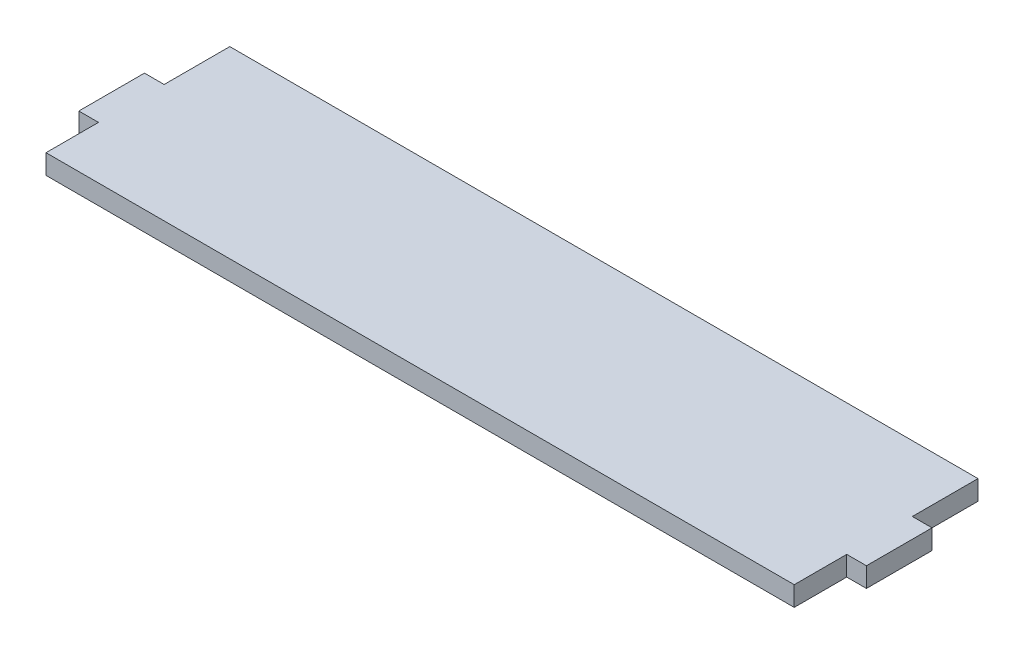
ISO-10303-21;
HEADER;
FILE_DESCRIPTION(('STEP AP214'),'2;1');
FILE_NAME('part.step','',(''),(''),'','','');
FILE_SCHEMA(('AUTOMOTIVE_DESIGN { 1 0 10303 214 1 1 1 1 }'));
ENDSEC;
DATA;
#1=APPLICATION_CONTEXT('core data for automotive mechanical design processes');
#2=APPLICATION_PROTOCOL_DEFINITION('international standard','automotive_design',2000,#1);
#3=PRODUCT_CONTEXT('',#1,'mechanical');
#4=PRODUCT('Part','Part','',(#3));
#5=PRODUCT_RELATED_PRODUCT_CATEGORY('part','',(#4));
#6=PRODUCT_DEFINITION_FORMATION('','',#4);
#7=PRODUCT_DEFINITION_CONTEXT('part definition',#1,'design');
#8=PRODUCT_DEFINITION('design','',#6,#7);
#9=PRODUCT_DEFINITION_SHAPE('','',#8);
#10=(LENGTH_UNIT() NAMED_UNIT(*) SI_UNIT(.MILLI.,.METRE.));
#11=(NAMED_UNIT(*) PLANE_ANGLE_UNIT() SI_UNIT($,.RADIAN.));
#12=(NAMED_UNIT(*) SI_UNIT($,.STERADIAN.) SOLID_ANGLE_UNIT());
#13=UNCERTAINTY_MEASURE_WITH_UNIT(LENGTH_MEASURE(1.E-05),#10,'distance_accuracy_value','');
#14=(GEOMETRIC_REPRESENTATION_CONTEXT(3) GLOBAL_UNCERTAINTY_ASSIGNED_CONTEXT((#13)) GLOBAL_UNIT_ASSIGNED_CONTEXT((#10,
#11,#12)) REPRESENTATION_CONTEXT('',''));
#15=CARTESIAN_POINT('',(0.,0.,0.));
#16=DIRECTION('',(0.,0.,1.));
#17=DIRECTION('',(1.,0.,0.));
#18=AXIS2_PLACEMENT_3D('',#15,#16,#17);
#19=CARTESIAN_POINT('',(-57.,3.,-3.99999999999999));
#20=DIRECTION('',(1.,0.,0.));
#21=DIRECTION('',(0.,0.,-1.));
#22=AXIS2_PLACEMENT_3D('',#19,#20,#21);
#23=PLANE('',#22);
#24=DIRECTION('',(0.,0.,1.));
#25=VECTOR('',#24,1.);
#26=CARTESIAN_POINT('',(-57.,0.,-3.99999999999999));
#27=LINE('',#26,#25);
#28=CARTESIAN_POINT('',(-57.,0.,-14.));
#29=VERTEX_POINT('',#28);
#30=CARTESIAN_POINT('',(-57.,0.,-3.99999999999999));
#31=VERTEX_POINT('',#30);
#32=EDGE_CURVE('E155',#29,#31,#27,.T.);
#33=ORIENTED_EDGE('',*,*,#32,.T.);
#34=DIRECTION('',(0.,-1.,0.));
#35=VECTOR('',#34,1.);
#36=CARTESIAN_POINT('',(-57.,3.,-3.99999999999999));
#37=LINE('',#36,#35);
#38=CARTESIAN_POINT('',(-57.,3.,-3.99999999999999));
#39=VERTEX_POINT('',#38);
#40=EDGE_CURVE('E11',#39,#31,#37,.T.);
#41=ORIENTED_EDGE('',*,*,#40,.F.);
#42=DIRECTION('',(0.,0.,1.));
#43=VECTOR('',#42,1.);
#44=CARTESIAN_POINT('',(-57.,3.,-3.99999999999999));
#45=LINE('',#44,#43);
#46=CARTESIAN_POINT('',(-57.,3.,-14.));
#47=VERTEX_POINT('',#46);
#48=EDGE_CURVE('E177',#47,#39,#45,.T.);
#49=ORIENTED_EDGE('',*,*,#48,.F.);
#50=DIRECTION('',(0.,-1.,0.));
#51=VECTOR('',#50,1.);
#52=CARTESIAN_POINT('',(-57.,3.,-14.));
#53=LINE('',#52,#51);
#54=EDGE_CURVE('E151',#47,#29,#53,.T.);
#55=ORIENTED_EDGE('',*,*,#54,.T.);
#56=EDGE_LOOP('',(#33,#41,#49,#55));
#57=FACE_BOUND('',#56,.T.);
#58=ADVANCED_FACE('F35',(#57),#23,.F.);
#59=CARTESIAN_POINT('',(-57.,3.,-3.99999999999999));
#60=DIRECTION('',(0.,0.,1.));
#61=DIRECTION('',(1.,0.,0.));
#62=AXIS2_PLACEMENT_3D('',#59,#60,#61);
#63=PLANE('',#62);
#64=DIRECTION('',(-1.,0.,0.));
#65=VECTOR('',#64,1.);
#66=CARTESIAN_POINT('',(-57.,0.,-3.99999999999999));
#67=LINE('',#66,#65);
#68=CARTESIAN_POINT('',(-60.,0.,-3.99999999999999));
#69=VERTEX_POINT('',#68);
#70=EDGE_CURVE('E158',#31,#69,#67,.T.);
#71=ORIENTED_EDGE('',*,*,#70,.T.);
#72=DIRECTION('',(0.,-1.,0.));
#73=VECTOR('',#72,1.);
#74=CARTESIAN_POINT('',(-60.,3.,-3.99999999999999));
#75=LINE('',#74,#73);
#76=CARTESIAN_POINT('',(-60.,3.,-3.99999999999999));
#77=VERTEX_POINT('',#76);
#78=EDGE_CURVE('E43',#77,#69,#75,.T.);
#79=ORIENTED_EDGE('',*,*,#78,.F.);
#80=DIRECTION('',(-1.,0.,0.));
#81=VECTOR('',#80,1.);
#82=CARTESIAN_POINT('',(-57.,3.,-3.99999999999999));
#83=LINE('',#82,#81);
#84=EDGE_CURVE('E106',#39,#77,#83,.T.);
#85=ORIENTED_EDGE('',*,*,#84,.F.);
#86=ORIENTED_EDGE('',*,*,#40,.T.);
#87=EDGE_LOOP('',(#71,#79,#85,#86));
#88=FACE_BOUND('',#87,.T.);
#89=ADVANCED_FACE('F255',(#88),#63,.F.);
#90=CARTESIAN_POINT('',(-60.,3.,-3.99999999999999));
#91=DIRECTION('',(1.,0.,0.));
#92=DIRECTION('',(0.,0.,-1.));
#93=AXIS2_PLACEMENT_3D('',#90,#91,#92);
#94=PLANE('',#93);
#95=DIRECTION('',(0.,0.,1.));
#96=VECTOR('',#95,1.);
#97=CARTESIAN_POINT('',(-60.,0.,-3.99999999999999));
#98=LINE('',#97,#96);
#99=CARTESIAN_POINT('',(-60.,0.,6.00000000000001));
#100=VERTEX_POINT('',#99);
#101=EDGE_CURVE('E160',#69,#100,#98,.T.);
#102=ORIENTED_EDGE('',*,*,#101,.T.);
#103=DIRECTION('',(0.,-1.,0.));
#104=VECTOR('',#103,1.);
#105=CARTESIAN_POINT('',(-60.,3.,6.00000000000001));
#106=LINE('',#105,#104);
#107=CARTESIAN_POINT('',(-60.,3.,6.00000000000001));
#108=VERTEX_POINT('',#107);
#109=EDGE_CURVE('E196',#108,#100,#106,.T.);
#110=ORIENTED_EDGE('',*,*,#109,.F.);
#111=DIRECTION('',(0.,0.,1.));
#112=VECTOR('',#111,1.);
#113=CARTESIAN_POINT('',(-60.,3.,-3.99999999999999));
#114=LINE('',#113,#112);
#115=EDGE_CURVE('E204',#77,#108,#114,.T.);
#116=ORIENTED_EDGE('',*,*,#115,.F.);
#117=ORIENTED_EDGE('',*,*,#78,.T.);
#118=EDGE_LOOP('',(#102,#110,#116,#117));
#119=FACE_BOUND('',#118,.T.);
#120=ADVANCED_FACE('F202',(#119),#94,.F.);
#121=CARTESIAN_POINT('',(-60.,3.,6.00000000000001));
#122=DIRECTION('',(0.,0.,-1.));
#123=DIRECTION('',(-1.,0.,0.));
#124=AXIS2_PLACEMENT_3D('',#121,#122,#123);
#125=PLANE('',#124);
#126=DIRECTION('',(1.,0.,0.));
#127=VECTOR('',#126,1.);
#128=CARTESIAN_POINT('',(-60.,0.,6.00000000000001));
#129=LINE('',#128,#127);
#130=CARTESIAN_POINT('',(-57.,0.,6.00000000000001));
#131=VERTEX_POINT('',#130);
#132=EDGE_CURVE('E162',#100,#131,#129,.T.);
#133=ORIENTED_EDGE('',*,*,#132,.T.);
#134=DIRECTION('',(0.,-1.,0.));
#135=VECTOR('',#134,1.);
#136=CARTESIAN_POINT('',(-57.,3.,6.00000000000001));
#137=LINE('',#136,#135);
#138=CARTESIAN_POINT('',(-57.,3.,6.00000000000001));
#139=VERTEX_POINT('',#138);
#140=EDGE_CURVE('E193',#139,#131,#137,.T.);
#141=ORIENTED_EDGE('',*,*,#140,.F.);
#142=DIRECTION('',(1.,0.,0.));
#143=VECTOR('',#142,1.);
#144=CARTESIAN_POINT('',(-60.,3.,6.00000000000001));
#145=LINE('',#144,#143);
#146=EDGE_CURVE('E222',#108,#139,#145,.T.);
#147=ORIENTED_EDGE('',*,*,#146,.F.);
#148=ORIENTED_EDGE('',*,*,#109,.T.);
#149=EDGE_LOOP('',(#133,#141,#147,#148));
#150=FACE_BOUND('',#149,.T.);
#151=ADVANCED_FACE('F213',(#150),#125,.F.);
#152=CARTESIAN_POINT('',(-57.,3.,14.));
#153=DIRECTION('',(1.,0.,0.));
#154=DIRECTION('',(0.,0.,-1.));
#155=AXIS2_PLACEMENT_3D('',#152,#153,#154);
#156=PLANE('',#155);
#157=DIRECTION('',(0.,0.,1.));
#158=VECTOR('',#157,1.);
#159=CARTESIAN_POINT('',(-57.,0.,14.));
#160=LINE('',#159,#158);
#161=CARTESIAN_POINT('',(-57.,0.,14.));
#162=VERTEX_POINT('',#161);
#163=EDGE_CURVE('E164',#131,#162,#160,.T.);
#164=ORIENTED_EDGE('',*,*,#163,.T.);
#165=DIRECTION('',(0.,-1.,0.));
#166=VECTOR('',#165,1.);
#167=CARTESIAN_POINT('',(-57.,3.,14.));
#168=LINE('',#167,#166);
#169=CARTESIAN_POINT('',(-57.,3.,14.));
#170=VERTEX_POINT('',#169);
#171=EDGE_CURVE('E190',#170,#162,#168,.T.);
#172=ORIENTED_EDGE('',*,*,#171,.F.);
#173=DIRECTION('',(0.,0.,1.));
#174=VECTOR('',#173,1.);
#175=CARTESIAN_POINT('',(-57.,3.,14.));
#176=LINE('',#175,#174);
#177=EDGE_CURVE('E219',#139,#170,#176,.T.);
#178=ORIENTED_EDGE('',*,*,#177,.F.);
#179=ORIENTED_EDGE('',*,*,#140,.T.);
#180=EDGE_LOOP('',(#164,#172,#178,#179));
#181=FACE_BOUND('',#180,.T.);
#182=ADVANCED_FACE('F217',(#181),#156,.F.);
#183=CARTESIAN_POINT('',(57.,3.,14.));
#184=DIRECTION('',(0.,0.,-1.));
#185=DIRECTION('',(-1.,0.,0.));
#186=AXIS2_PLACEMENT_3D('',#183,#184,#185);
#187=PLANE('',#186);
#188=DIRECTION('',(1.,0.,0.));
#189=VECTOR('',#188,1.);
#190=CARTESIAN_POINT('',(57.,0.,14.));
#191=LINE('',#190,#189);
#192=CARTESIAN_POINT('',(57.,0.,14.));
#193=VERTEX_POINT('',#192);
#194=EDGE_CURVE('E166',#162,#193,#191,.T.);
#195=ORIENTED_EDGE('',*,*,#194,.T.);
#196=DIRECTION('',(0.,-1.,0.));
#197=VECTOR('',#196,1.);
#198=CARTESIAN_POINT('',(57.,3.,14.));
#199=LINE('',#198,#197);
#200=CARTESIAN_POINT('',(57.,3.,14.));
#201=VERTEX_POINT('',#200);
#202=EDGE_CURVE('E187',#201,#193,#199,.T.);
#203=ORIENTED_EDGE('',*,*,#202,.F.);
#204=DIRECTION('',(1.,0.,0.));
#205=VECTOR('',#204,1.);
#206=CARTESIAN_POINT('',(57.,3.,14.));
#207=LINE('',#206,#205);
#208=EDGE_CURVE('E221',#170,#201,#207,.T.);
#209=ORIENTED_EDGE('',*,*,#208,.F.);
#210=ORIENTED_EDGE('',*,*,#171,.T.);
#211=EDGE_LOOP('',(#195,#203,#209,#210));
#212=FACE_BOUND('',#211,.T.);
#213=ADVANCED_FACE('F268',(#212),#187,.F.);
#214=CARTESIAN_POINT('',(57.,3.,14.));
#215=DIRECTION('',(-1.,0.,0.));
#216=DIRECTION('',(0.,0.,1.));
#217=AXIS2_PLACEMENT_3D('',#214,#215,#216);
#218=PLANE('',#217);
#219=DIRECTION('',(0.,0.,-1.));
#220=VECTOR('',#219,1.);
#221=CARTESIAN_POINT('',(57.,0.,14.));
#222=LINE('',#221,#220);
#223=CARTESIAN_POINT('',(57.,0.,6.));
#224=VERTEX_POINT('',#223);
#225=EDGE_CURVE('E168',#193,#224,#222,.T.);
#226=ORIENTED_EDGE('',*,*,#225,.T.);
#227=DIRECTION('',(0.,-1.,0.));
#228=VECTOR('',#227,1.);
#229=CARTESIAN_POINT('',(57.,3.,6.));
#230=LINE('',#229,#228);
#231=CARTESIAN_POINT('',(57.,3.,6.));
#232=VERTEX_POINT('',#231);
#233=EDGE_CURVE('E184',#232,#224,#230,.T.);
#234=ORIENTED_EDGE('',*,*,#233,.F.);
#235=DIRECTION('',(0.,0.,-1.));
#236=VECTOR('',#235,1.);
#237=CARTESIAN_POINT('',(57.,3.,14.));
#238=LINE('',#237,#236);
#239=EDGE_CURVE('E224',#201,#232,#238,.T.);
#240=ORIENTED_EDGE('',*,*,#239,.F.);
#241=ORIENTED_EDGE('',*,*,#202,.T.);
#242=EDGE_LOOP('',(#226,#234,#240,#241));
#243=FACE_BOUND('',#242,.T.);
#244=ADVANCED_FACE('F271',(#243),#218,.F.);
#245=CARTESIAN_POINT('',(60.,3.,5.99999999999999));
#246=DIRECTION('',(0.,0.,-1.));
#247=DIRECTION('',(-1.,0.,0.));
#248=AXIS2_PLACEMENT_3D('',#245,#246,#247);
#249=PLANE('',#248);
#250=DIRECTION('',(1.,0.,0.));
#251=VECTOR('',#250,1.);
#252=CARTESIAN_POINT('',(60.,0.,5.99999999999999));
#253=LINE('',#252,#251);
#254=CARTESIAN_POINT('',(60.,0.,5.99999999999999));
#255=VERTEX_POINT('',#254);
#256=EDGE_CURVE('E170',#224,#255,#253,.T.);
#257=ORIENTED_EDGE('',*,*,#256,.T.);
#258=DIRECTION('',(0.,-1.,0.));
#259=VECTOR('',#258,1.);
#260=CARTESIAN_POINT('',(60.,3.,5.99999999999999));
#261=LINE('',#260,#259);
#262=CARTESIAN_POINT('',(60.,3.,5.99999999999999));
#263=VERTEX_POINT('',#262);
#264=EDGE_CURVE('E181',#263,#255,#261,.T.);
#265=ORIENTED_EDGE('',*,*,#264,.F.);
#266=DIRECTION('',(1.,0.,0.));
#267=VECTOR('',#266,1.);
#268=CARTESIAN_POINT('',(60.,3.,5.99999999999999));
#269=LINE('',#268,#267);
#270=EDGE_CURVE('E230',#232,#263,#269,.T.);
#271=ORIENTED_EDGE('',*,*,#270,.F.);
#272=ORIENTED_EDGE('',*,*,#233,.T.);
#273=EDGE_LOOP('',(#257,#265,#271,#272));
#274=FACE_BOUND('',#273,.T.);
#275=ADVANCED_FACE('F236',(#274),#249,.F.);
#276=CARTESIAN_POINT('',(60.,3.,-4.00000000000001));
#277=DIRECTION('',(-1.,0.,0.));
#278=DIRECTION('',(0.,0.,1.));
#279=AXIS2_PLACEMENT_3D('',#276,#277,#278);
#280=PLANE('',#279);
#281=DIRECTION('',(0.,0.,-1.));
#282=VECTOR('',#281,1.);
#283=CARTESIAN_POINT('',(60.,0.,-4.00000000000001));
#284=LINE('',#283,#282);
#285=CARTESIAN_POINT('',(60.,0.,-4.00000000000001));
#286=VERTEX_POINT('',#285);
#287=EDGE_CURVE('E172',#255,#286,#284,.T.);
#288=ORIENTED_EDGE('',*,*,#287,.T.);
#289=DIRECTION('',(0.,-1.,0.));
#290=VECTOR('',#289,1.);
#291=CARTESIAN_POINT('',(60.,3.,-4.00000000000001));
#292=LINE('',#291,#290);
#293=CARTESIAN_POINT('',(60.,3.,-4.00000000000001));
#294=VERTEX_POINT('',#293);
#295=EDGE_CURVE('E146',#294,#286,#292,.T.);
#296=ORIENTED_EDGE('',*,*,#295,.F.);
#297=DIRECTION('',(0.,0.,-1.));
#298=VECTOR('',#297,1.);
#299=CARTESIAN_POINT('',(60.,3.,-4.00000000000001));
#300=LINE('',#299,#298);
#301=EDGE_CURVE('E137',#263,#294,#300,.T.);
#302=ORIENTED_EDGE('',*,*,#301,.F.);
#303=ORIENTED_EDGE('',*,*,#264,.T.);
#304=EDGE_LOOP('',(#288,#296,#302,#303));
#305=FACE_BOUND('',#304,.T.);
#306=ADVANCED_FACE('F240',(#305),#280,.F.);
#307=CARTESIAN_POINT('',(57.,3.,-4.00000000000001));
#308=DIRECTION('',(0.,0.,1.));
#309=DIRECTION('',(1.,0.,0.));
#310=AXIS2_PLACEMENT_3D('',#307,#308,#309);
#311=PLANE('',#310);
#312=DIRECTION('',(-1.,0.,0.));
#313=VECTOR('',#312,1.);
#314=CARTESIAN_POINT('',(57.,0.,-4.00000000000001));
#315=LINE('',#314,#313);
#316=CARTESIAN_POINT('',(57.,0.,-4.00000000000001));
#317=VERTEX_POINT('',#316);
#318=EDGE_CURVE('E145',#286,#317,#315,.T.);
#319=ORIENTED_EDGE('',*,*,#318,.T.);
#320=DIRECTION('',(0.,-1.,0.));
#321=VECTOR('',#320,1.);
#322=CARTESIAN_POINT('',(57.,3.,-4.00000000000001));
#323=LINE('',#322,#321);
#324=CARTESIAN_POINT('',(57.,3.,-4.00000000000001));
#325=VERTEX_POINT('',#324);
#326=EDGE_CURVE('E142',#325,#317,#323,.T.);
#327=ORIENTED_EDGE('',*,*,#326,.F.);
#328=DIRECTION('',(-1.,0.,0.));
#329=VECTOR('',#328,1.);
#330=CARTESIAN_POINT('',(57.,3.,-4.00000000000001));
#331=LINE('',#330,#329);
#332=EDGE_CURVE('E131',#294,#325,#331,.T.);
#333=ORIENTED_EDGE('',*,*,#332,.F.);
#334=ORIENTED_EDGE('',*,*,#295,.T.);
#335=EDGE_LOOP('',(#319,#327,#333,#334));
#336=FACE_BOUND('',#335,.T.);
#337=ADVANCED_FACE('F143',(#336),#311,.F.);
#338=CARTESIAN_POINT('',(57.,3.,-4.00000000000001));
#339=DIRECTION('',(-1.,0.,0.));
#340=DIRECTION('',(0.,0.,1.));
#341=AXIS2_PLACEMENT_3D('',#338,#339,#340);
#342=PLANE('',#341);
#343=DIRECTION('',(0.,0.,-1.));
#344=VECTOR('',#343,1.);
#345=CARTESIAN_POINT('',(57.,0.,-4.00000000000001));
#346=LINE('',#345,#344);
#347=CARTESIAN_POINT('',(57.,0.,-14.));
#348=VERTEX_POINT('',#347);
#349=EDGE_CURVE('E92',#317,#348,#346,.T.);
#350=ORIENTED_EDGE('',*,*,#349,.T.);
#351=DIRECTION('',(0.,-1.,0.));
#352=VECTOR('',#351,1.);
#353=CARTESIAN_POINT('',(57.,3.,-14.));
#354=LINE('',#353,#352);
#355=CARTESIAN_POINT('',(57.,3.,-14.));
#356=VERTEX_POINT('',#355);
#357=EDGE_CURVE('E147',#356,#348,#354,.T.);
#358=ORIENTED_EDGE('',*,*,#357,.F.);
#359=DIRECTION('',(0.,0.,-1.));
#360=VECTOR('',#359,1.);
#361=CARTESIAN_POINT('',(57.,3.,-4.00000000000001));
#362=LINE('',#361,#360);
#363=EDGE_CURVE('E135',#325,#356,#362,.T.);
#364=ORIENTED_EDGE('',*,*,#363,.F.);
#365=ORIENTED_EDGE('',*,*,#326,.T.);
#366=EDGE_LOOP('',(#350,#358,#364,#365));
#367=FACE_BOUND('',#366,.T.);
#368=ADVANCED_FACE('F149',(#367),#342,.F.);
#369=CARTESIAN_POINT('',(57.,3.,-14.));
#370=DIRECTION('',(0.,0.,1.));
#371=DIRECTION('',(1.,0.,0.));
#372=AXIS2_PLACEMENT_3D('',#369,#370,#371);
#373=PLANE('',#372);
#374=DIRECTION('',(-1.,0.,0.));
#375=VECTOR('',#374,1.);
#376=CARTESIAN_POINT('',(57.,0.,-14.));
#377=LINE('',#376,#375);
#378=EDGE_CURVE('E98',#348,#29,#377,.T.);
#379=ORIENTED_EDGE('',*,*,#378,.T.);
#380=ORIENTED_EDGE('',*,*,#54,.F.);
#381=DIRECTION('',(-1.,0.,0.));
#382=VECTOR('',#381,1.);
#383=CARTESIAN_POINT('',(57.,3.,-14.));
#384=LINE('',#383,#382);
#385=EDGE_CURVE('E51',#356,#47,#384,.T.);
#386=ORIENTED_EDGE('',*,*,#385,.F.);
#387=ORIENTED_EDGE('',*,*,#357,.T.);
#388=EDGE_LOOP('',(#379,#380,#386,#387));
#389=FACE_BOUND('',#388,.T.);
#390=ADVANCED_FACE('F244',(#389),#373,.F.);
#391=CARTESIAN_POINT('',(0.,3.,0.));
#392=DIRECTION('',(0.,1.,0.));
#393=DIRECTION('',(0.,0.,1.));
#394=AXIS2_PLACEMENT_3D('',#391,#392,#393);
#395=PLANE('',#394);
#396=ORIENTED_EDGE('',*,*,#48,.T.);
#397=ORIENTED_EDGE('',*,*,#84,.T.);
#398=ORIENTED_EDGE('',*,*,#115,.T.);
#399=ORIENTED_EDGE('',*,*,#146,.T.);
#400=ORIENTED_EDGE('',*,*,#177,.T.);
#401=ORIENTED_EDGE('',*,*,#208,.T.);
#402=ORIENTED_EDGE('',*,*,#239,.T.);
#403=ORIENTED_EDGE('',*,*,#270,.T.);
#404=ORIENTED_EDGE('',*,*,#301,.T.);
#405=ORIENTED_EDGE('',*,*,#332,.T.);
#406=ORIENTED_EDGE('',*,*,#363,.T.);
#407=ORIENTED_EDGE('',*,*,#385,.T.);
#408=EDGE_LOOP('',(#396,#397,#398,#399,#400,#401,#402,#403,#404,#405,#406,#407));
#409=FACE_BOUND('',#408,.T.);
#410=ADVANCED_FACE('F133',(#409),#395,.T.);
#411=CARTESIAN_POINT('',(0.,0.,0.));
#412=DIRECTION('',(0.,1.,0.));
#413=DIRECTION('',(0.,0.,1.));
#414=AXIS2_PLACEMENT_3D('',#411,#412,#413);
#415=PLANE('',#414);
#416=ORIENTED_EDGE('',*,*,#32,.F.);
#417=ORIENTED_EDGE('',*,*,#378,.F.);
#418=ORIENTED_EDGE('',*,*,#349,.F.);
#419=ORIENTED_EDGE('',*,*,#318,.F.);
#420=ORIENTED_EDGE('',*,*,#287,.F.);
#421=ORIENTED_EDGE('',*,*,#256,.F.);
#422=ORIENTED_EDGE('',*,*,#225,.F.);
#423=ORIENTED_EDGE('',*,*,#194,.F.);
#424=ORIENTED_EDGE('',*,*,#163,.F.);
#425=ORIENTED_EDGE('',*,*,#132,.F.);
#426=ORIENTED_EDGE('',*,*,#101,.F.);
#427=ORIENTED_EDGE('',*,*,#70,.F.);
#428=EDGE_LOOP('',(#416,#417,#418,#419,#420,#421,#422,#423,#424,#425,#426,#427));
#429=FACE_BOUND('',#428,.T.);
#430=ADVANCED_FACE('F208',(#429),#415,.F.);
#431=CLOSED_SHELL('',(#58,#89,#120,#151,#182,#213,#244,#275,#306,#337,#368,#390,#410,#430));
#432=MANIFOLD_SOLID_BREP('B2',#431);
#433=ADVANCED_BREP_SHAPE_REPRESENTATION('',(#18,#432),#14);
#434=SHAPE_DEFINITION_REPRESENTATION(#9,#433);
ENDSEC;
END-ISO-10303-21;
